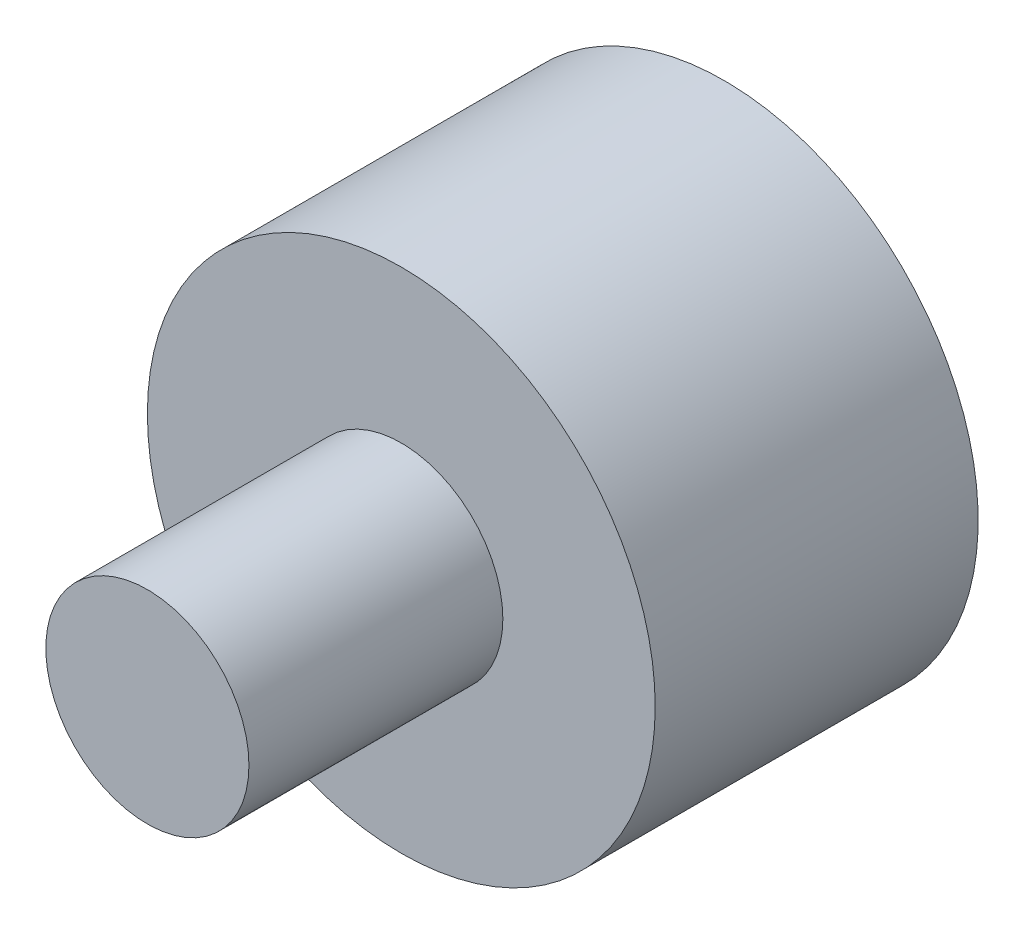
ISO-10303-21;
HEADER;
FILE_DESCRIPTION(('STEP AP214'),'2;1');
FILE_NAME('part.step','',(''),(''),'','','');
FILE_SCHEMA(('AUTOMOTIVE_DESIGN { 1 0 10303 214 1 1 1 1 }'));
ENDSEC;
DATA;
#1=APPLICATION_CONTEXT('core data for automotive mechanical design processes');
#2=APPLICATION_PROTOCOL_DEFINITION('international standard','automotive_design',2000,#1);
#3=PRODUCT_CONTEXT('',#1,'mechanical');
#4=PRODUCT('Part','Part','',(#3));
#5=PRODUCT_RELATED_PRODUCT_CATEGORY('part','',(#4));
#6=PRODUCT_DEFINITION_FORMATION('','',#4);
#7=PRODUCT_DEFINITION_CONTEXT('part definition',#1,'design');
#8=PRODUCT_DEFINITION('design','',#6,#7);
#9=PRODUCT_DEFINITION_SHAPE('','',#8);
#10=(LENGTH_UNIT() NAMED_UNIT(*) SI_UNIT(.MILLI.,.METRE.));
#11=(NAMED_UNIT(*) PLANE_ANGLE_UNIT() SI_UNIT($,.RADIAN.));
#12=(NAMED_UNIT(*) SI_UNIT($,.STERADIAN.) SOLID_ANGLE_UNIT());
#13=UNCERTAINTY_MEASURE_WITH_UNIT(LENGTH_MEASURE(1.E-05),#10,'distance_accuracy_value','');
#14=(GEOMETRIC_REPRESENTATION_CONTEXT(3) GLOBAL_UNCERTAINTY_ASSIGNED_CONTEXT((#13)) GLOBAL_UNIT_ASSIGNED_CONTEXT((#10,
#11,#12)) REPRESENTATION_CONTEXT('',''));
#15=CARTESIAN_POINT('',(0.,0.,0.));
#16=DIRECTION('',(0.,0.,1.));
#17=DIRECTION('',(1.,0.,0.));
#18=AXIS2_PLACEMENT_3D('',#15,#16,#17);
#19=CARTESIAN_POINT('',(0.,0.,3.36));
#20=DIRECTION('',(0.,0.,-1.));
#21=DIRECTION('',(-1.,0.,0.));
#22=AXIS2_PLACEMENT_3D('',#19,#20,#21);
#23=CYLINDRICAL_SURFACE('',#22,5.);
#24=CARTESIAN_POINT('',(0.,0.,3.36));
#25=DIRECTION('',(0.,0.,1.));
#26=DIRECTION('',(1.,0.,0.));
#27=AXIS2_PLACEMENT_3D('',#24,#25,#26);
#28=CIRCLE('',#27,5.);
#29=CARTESIAN_POINT('',(5.,0.,3.36));
#30=VERTEX_POINT('',#29);
#31=EDGE_CURVE('E40',#30,#30,#28,.T.);
#32=ORIENTED_EDGE('',*,*,#31,.F.);
#33=EDGE_LOOP('',(#32));
#34=FACE_BOUND('',#33,.T.);
#35=CARTESIAN_POINT('',(0.,0.,-3.));
#36=DIRECTION('',(0.,0.,-1.));
#37=DIRECTION('',(-1.,0.,0.));
#38=AXIS2_PLACEMENT_3D('',#35,#36,#37);
#39=CIRCLE('',#38,5.);
#40=CARTESIAN_POINT('',(-5.,0.,-3.));
#41=VERTEX_POINT('',#40);
#42=EDGE_CURVE('E54',#41,#41,#39,.T.);
#43=ORIENTED_EDGE('',*,*,#42,.F.);
#44=EDGE_LOOP('',(#43));
#45=FACE_BOUND('',#44,.T.);
#46=ADVANCED_FACE('F37',(#34,#45),#23,.T.);
#47=CARTESIAN_POINT('',(0.,0.,3.36));
#48=DIRECTION('',(0.,0.,1.));
#49=DIRECTION('',(1.,0.,0.));
#50=AXIS2_PLACEMENT_3D('',#47,#48,#49);
#51=PLANE('',#50);
#52=CARTESIAN_POINT('',(0.,0.,3.36));
#53=DIRECTION('',(0.,0.,1.));
#54=DIRECTION('',(1.,0.,0.));
#55=AXIS2_PLACEMENT_3D('',#52,#53,#54);
#56=CIRCLE('',#55,2.);
#57=CARTESIAN_POINT('',(2.,0.,3.36));
#58=VERTEX_POINT('',#57);
#59=EDGE_CURVE('E10',#58,#58,#56,.T.);
#60=ORIENTED_EDGE('',*,*,#59,.F.);
#61=EDGE_LOOP('',(#60));
#62=FACE_BOUND('',#61,.T.);
#63=ORIENTED_EDGE('',*,*,#31,.T.);
#64=EDGE_LOOP('',(#63));
#65=FACE_BOUND('',#64,.T.);
#66=ADVANCED_FACE('F62',(#62,#65),#51,.T.);
#67=CARTESIAN_POINT('',(0.,0.,8.36));
#68=DIRECTION('',(0.,0.,-1.));
#69=DIRECTION('',(-1.,0.,0.));
#70=AXIS2_PLACEMENT_3D('',#67,#68,#69);
#71=CYLINDRICAL_SURFACE('',#70,2.);
#72=CARTESIAN_POINT('',(0.,0.,8.36));
#73=DIRECTION('',(0.,0.,1.));
#74=DIRECTION('',(1.,0.,0.));
#75=AXIS2_PLACEMENT_3D('',#72,#73,#74);
#76=CIRCLE('',#75,2.);
#77=CARTESIAN_POINT('',(2.,0.,8.36));
#78=VERTEX_POINT('',#77);
#79=EDGE_CURVE('E49',#78,#78,#76,.T.);
#80=ORIENTED_EDGE('',*,*,#79,.F.);
#81=EDGE_LOOP('',(#80));
#82=FACE_BOUND('',#81,.T.);
#83=ORIENTED_EDGE('',*,*,#59,.T.);
#84=EDGE_LOOP('',(#83));
#85=FACE_BOUND('',#84,.T.);
#86=ADVANCED_FACE('F69',(#82,#85),#71,.T.);
#87=CARTESIAN_POINT('',(0.,0.,8.36));
#88=DIRECTION('',(0.,0.,1.));
#89=DIRECTION('',(1.,0.,0.));
#90=AXIS2_PLACEMENT_3D('',#87,#88,#89);
#91=PLANE('',#90);
#92=ORIENTED_EDGE('',*,*,#79,.T.);
#93=EDGE_LOOP('',(#92));
#94=FACE_BOUND('',#93,.T.);
#95=ADVANCED_FACE('F76',(#94),#91,.T.);
#96=CARTESIAN_POINT('',(0.,0.,-3.));
#97=DIRECTION('',(0.,0.,-1.));
#98=DIRECTION('',(-1.,0.,0.));
#99=AXIS2_PLACEMENT_3D('',#96,#97,#98);
#100=PLANE('',#99);
#101=ORIENTED_EDGE('',*,*,#42,.T.);
#102=EDGE_LOOP('',(#101));
#103=FACE_BOUND('',#102,.T.);
#104=ADVANCED_FACE('F59',(#103),#100,.T.);
#105=CLOSED_SHELL('',(#46,#66,#86,#95,#104));
#106=MANIFOLD_SOLID_BREP('B2',#105);
#107=ADVANCED_BREP_SHAPE_REPRESENTATION('',(#18,#106),#14);
#108=SHAPE_DEFINITION_REPRESENTATION(#9,#107);
ENDSEC;
END-ISO-10303-21;
